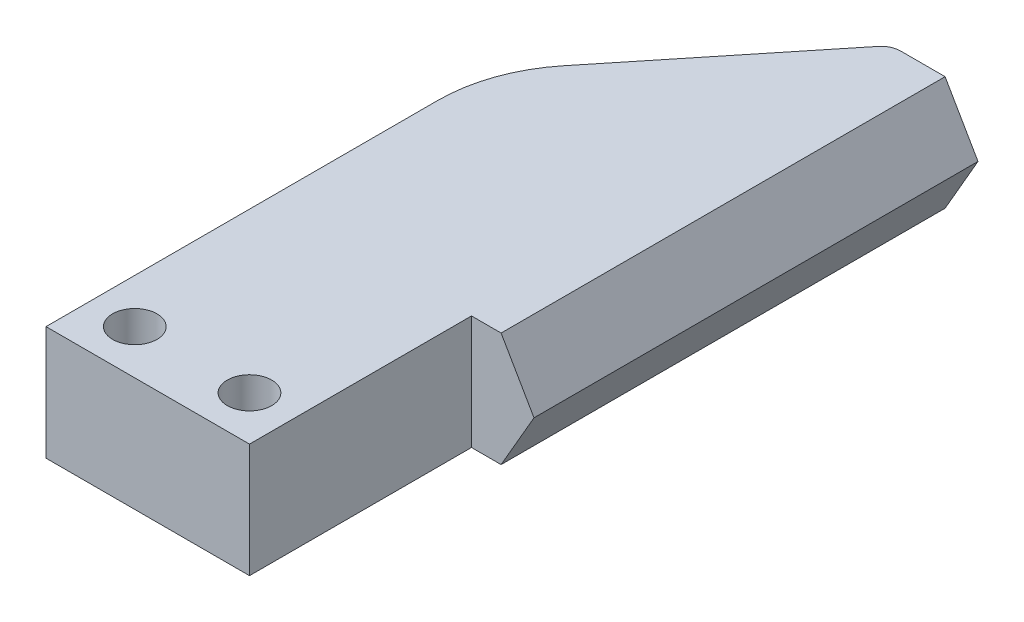
ISO-10303-21;
HEADER;
FILE_DESCRIPTION(('STEP AP214'),'2;1');
FILE_NAME('part.step','',(''),(''),'','','');
FILE_SCHEMA(('AUTOMOTIVE_DESIGN { 1 0 10303 214 1 1 1 1 }'));
ENDSEC;
DATA;
#1=APPLICATION_CONTEXT('core data for automotive mechanical design processes');
#2=APPLICATION_PROTOCOL_DEFINITION('international standard','automotive_design',2000,#1);
#3=PRODUCT_CONTEXT('',#1,'mechanical');
#4=PRODUCT('Part','Part','',(#3));
#5=PRODUCT_RELATED_PRODUCT_CATEGORY('part','',(#4));
#6=PRODUCT_DEFINITION_FORMATION('','',#4);
#7=PRODUCT_DEFINITION_CONTEXT('part definition',#1,'design');
#8=PRODUCT_DEFINITION('design','',#6,#7);
#9=PRODUCT_DEFINITION_SHAPE('','',#8);
#10=(LENGTH_UNIT() NAMED_UNIT(*) SI_UNIT(.MILLI.,.METRE.));
#11=(NAMED_UNIT(*) PLANE_ANGLE_UNIT() SI_UNIT($,.RADIAN.));
#12=(NAMED_UNIT(*) SI_UNIT($,.STERADIAN.) SOLID_ANGLE_UNIT());
#13=UNCERTAINTY_MEASURE_WITH_UNIT(LENGTH_MEASURE(1.E-05),#10,'distance_accuracy_value','');
#14=(GEOMETRIC_REPRESENTATION_CONTEXT(3) GLOBAL_UNCERTAINTY_ASSIGNED_CONTEXT((#13)) GLOBAL_UNIT_ASSIGNED_CONTEXT((#10,
#11,#12)) REPRESENTATION_CONTEXT('',''));
#15=CARTESIAN_POINT('',(0.,0.,0.));
#16=DIRECTION('',(0.,0.,1.));
#17=DIRECTION('',(1.,0.,0.));
#18=AXIS2_PLACEMENT_3D('',#15,#16,#17);
#19=CARTESIAN_POINT('',(-3.75,3.85,-11.4668726814975));
#20=DIRECTION('',(0.,-1.,0.));
#21=DIRECTION('',(0.,0.,-1.));
#22=AXIS2_PLACEMENT_3D('',#19,#20,#21);
#23=CYLINDRICAL_SURFACE('',#22,10.);
#24=CARTESIAN_POINT('',(-3.75,-3.85,-11.4668726814975));
#25=DIRECTION('',(0.,1.,0.));
#26=DIRECTION('',(0.,0.,1.));
#27=AXIS2_PLACEMENT_3D('',#24,#25,#26);
#28=CIRCLE('',#27,10.);
#29=CARTESIAN_POINT('',(-13.75,-3.85,-11.4668726814974));
#30=VERTEX_POINT('',#29);
#31=CARTESIAN_POINT('',(-11.5304663978605,-3.85,-17.7489378380972));
#32=VERTEX_POINT('',#31);
#33=EDGE_CURVE('E161',#30,#32,#28,.F.);
#34=ORIENTED_EDGE('',*,*,#33,.F.);
#35=DIRECTION('',(0.,-1.,0.));
#36=VECTOR('',#35,1.);
#37=CARTESIAN_POINT('',(-13.75,3.85,-11.4668726814974));
#38=LINE('',#37,#36);
#39=CARTESIAN_POINT('',(-13.75,3.85,-11.4668726814974));
#40=VERTEX_POINT('',#39);
#41=EDGE_CURVE('E12',#40,#30,#38,.T.);
#42=ORIENTED_EDGE('',*,*,#41,.F.);
#43=CARTESIAN_POINT('',(-3.75,3.85,-11.4668726814975));
#44=DIRECTION('',(0.,1.,0.));
#45=DIRECTION('',(0.,0.,1.));
#46=AXIS2_PLACEMENT_3D('',#43,#44,#45);
#47=CIRCLE('',#46,10.);
#48=CARTESIAN_POINT('',(-11.5304663978605,3.85,-17.7489378380972));
#49=VERTEX_POINT('',#48);
#50=EDGE_CURVE('E202',#40,#49,#47,.F.);
#51=ORIENTED_EDGE('',*,*,#50,.T.);
#52=DIRECTION('',(0.,-1.,0.));
#53=VECTOR('',#52,1.);
#54=CARTESIAN_POINT('',(-11.5304663978605,3.85,-17.7489378380972));
#55=LINE('',#54,#53);
#56=EDGE_CURVE('E64',#49,#32,#55,.T.);
#57=ORIENTED_EDGE('',*,*,#56,.T.);
#58=EDGE_LOOP('',(#34,#42,#51,#57));
#59=FACE_BOUND('',#58,.T.);
#60=ADVANCED_FACE('F47',(#59),#23,.T.);
#61=CARTESIAN_POINT('',(-13.75,3.85,0.));
#62=DIRECTION('',(-1.,0.,0.));
#63=DIRECTION('',(0.,0.,1.));
#64=AXIS2_PLACEMENT_3D('',#61,#62,#63);
#65=PLANE('',#64);
#66=DIRECTION('',(0.,0.,-1.));
#67=VECTOR('',#66,1.);
#68=CARTESIAN_POINT('',(-13.75,-3.85,0.));
#69=LINE('',#68,#67);
#70=CARTESIAN_POINT('',(-13.75,-3.85,15.));
#71=VERTEX_POINT('',#70);
#72=EDGE_CURVE('E164',#71,#30,#69,.T.);
#73=ORIENTED_EDGE('',*,*,#72,.F.);
#74=DIRECTION('',(0.,-1.,0.));
#75=VECTOR('',#74,1.);
#76=CARTESIAN_POINT('',(-13.75,3.85,15.));
#77=LINE('',#76,#75);
#78=CARTESIAN_POINT('',(-13.75,3.85,15.));
#79=VERTEX_POINT('',#78);
#80=EDGE_CURVE('E56',#79,#71,#77,.T.);
#81=ORIENTED_EDGE('',*,*,#80,.F.);
#82=DIRECTION('',(0.,0.,-1.));
#83=VECTOR('',#82,1.);
#84=CARTESIAN_POINT('',(-13.75,3.85,0.));
#85=LINE('',#84,#83);
#86=EDGE_CURVE('E227',#79,#40,#85,.T.);
#87=ORIENTED_EDGE('',*,*,#86,.T.);
#88=ORIENTED_EDGE('',*,*,#41,.T.);
#89=EDGE_LOOP('',(#73,#81,#87,#88));
#90=FACE_BOUND('',#89,.T.);
#91=ADVANCED_FACE('F226',(#90),#65,.T.);
#92=CARTESIAN_POINT('',(0.,3.85,15.));
#93=DIRECTION('',(0.,0.,-1.));
#94=DIRECTION('',(-1.,0.,0.));
#95=AXIS2_PLACEMENT_3D('',#92,#93,#94);
#96=PLANE('',#95);
#97=DIRECTION('',(1.,0.,0.));
#98=VECTOR('',#97,1.);
#99=CARTESIAN_POINT('',(0.,-3.85,15.));
#100=LINE('',#99,#98);
#101=CARTESIAN_POINT('',(0.,-3.85,15.));
#102=VERTEX_POINT('',#101);
#103=EDGE_CURVE('E169',#71,#102,#100,.T.);
#104=ORIENTED_EDGE('',*,*,#103,.T.);
#105=DIRECTION('',(0.,-1.,0.));
#106=VECTOR('',#105,1.);
#107=CARTESIAN_POINT('',(0.,3.85,15.));
#108=LINE('',#107,#106);
#109=CARTESIAN_POINT('',(0.,3.85,15.));
#110=VERTEX_POINT('',#109);
#111=EDGE_CURVE('E209',#110,#102,#108,.T.);
#112=ORIENTED_EDGE('',*,*,#111,.F.);
#113=DIRECTION('',(1.,0.,0.));
#114=VECTOR('',#113,1.);
#115=CARTESIAN_POINT('',(0.,3.85,15.));
#116=LINE('',#115,#114);
#117=EDGE_CURVE('E217',#79,#110,#116,.T.);
#118=ORIENTED_EDGE('',*,*,#117,.F.);
#119=ORIENTED_EDGE('',*,*,#80,.T.);
#120=EDGE_LOOP('',(#104,#112,#118,#119));
#121=FACE_BOUND('',#120,.T.);
#122=ADVANCED_FACE('F215',(#121),#96,.F.);
#123=CARTESIAN_POINT('',(0.,3.85,0.));
#124=DIRECTION('',(1.,0.,0.));
#125=DIRECTION('',(0.,0.,-1.));
#126=AXIS2_PLACEMENT_3D('',#123,#124,#125);
#127=PLANE('',#126);
#128=DIRECTION('',(0.,0.,1.));
#129=VECTOR('',#128,1.);
#130=CARTESIAN_POINT('',(0.,-3.85,0.));
#131=LINE('',#130,#129);
#132=CARTESIAN_POINT('',(0.,-3.85,0.));
#133=VERTEX_POINT('',#132);
#134=EDGE_CURVE('E173',#133,#102,#131,.T.);
#135=ORIENTED_EDGE('',*,*,#134,.F.);
#136=DIRECTION('',(0.,-1.,0.));
#137=VECTOR('',#136,1.);
#138=CARTESIAN_POINT('',(0.,3.85,0.));
#139=LINE('',#138,#137);
#140=CARTESIAN_POINT('',(0.,3.85,0.));
#141=VERTEX_POINT('',#140);
#142=EDGE_CURVE('E133',#141,#133,#139,.T.);
#143=ORIENTED_EDGE('',*,*,#142,.F.);
#144=DIRECTION('',(0.,0.,1.));
#145=VECTOR('',#144,1.);
#146=CARTESIAN_POINT('',(0.,3.85,0.));
#147=LINE('',#146,#145);
#148=EDGE_CURVE('E415',#141,#110,#147,.T.);
#149=ORIENTED_EDGE('',*,*,#148,.T.);
#150=ORIENTED_EDGE('',*,*,#111,.T.);
#151=EDGE_LOOP('',(#135,#143,#149,#150));
#152=FACE_BOUND('',#151,.T.);
#153=ADVANCED_FACE('F249',(#152),#127,.T.);
#154=CARTESIAN_POINT('',(0.,3.85,0.));
#155=DIRECTION('',(0.,0.,1.));
#156=DIRECTION('',(1.,0.,0.));
#157=AXIS2_PLACEMENT_3D('',#154,#155,#156);
#158=PLANE('',#157);
#159=DIRECTION('',(-1.,0.,0.));
#160=VECTOR('',#159,1.);
#161=CARTESIAN_POINT('',(0.,-3.85,0.));
#162=LINE('',#161,#160);
#163=CARTESIAN_POINT('',(2.,-3.85,0.));
#164=VERTEX_POINT('',#163);
#165=EDGE_CURVE('E177',#164,#133,#162,.T.);
#166=ORIENTED_EDGE('',*,*,#165,.F.);
#167=DIRECTION('',(-0.500000000000001,-0.866025403784438,0.));
#168=VECTOR('',#167,1.);
#169=CARTESIAN_POINT('',(4.22279853638006,0.,0.));
#170=LINE('',#169,#168);
#171=CARTESIAN_POINT('',(4.22279853638006,0.,0.));
#172=VERTEX_POINT('',#171);
#173=EDGE_CURVE('E404',#172,#164,#170,.T.);
#174=ORIENTED_EDGE('',*,*,#173,.F.);
#175=DIRECTION('',(0.500000000000001,-0.866025403784438,0.));
#176=VECTOR('',#175,1.);
#177=CARTESIAN_POINT('',(2.,3.85,0.));
#178=LINE('',#177,#176);
#179=CARTESIAN_POINT('',(2.,3.85,0.));
#180=VERTEX_POINT('',#179);
#181=EDGE_CURVE('E401',#180,#172,#178,.T.);
#182=ORIENTED_EDGE('',*,*,#181,.F.);
#183=DIRECTION('',(-1.,0.,0.));
#184=VECTOR('',#183,1.);
#185=CARTESIAN_POINT('',(0.,3.85,0.));
#186=LINE('',#185,#184);
#187=EDGE_CURVE('E419',#180,#141,#186,.T.);
#188=ORIENTED_EDGE('',*,*,#187,.T.);
#189=ORIENTED_EDGE('',*,*,#142,.T.);
#190=EDGE_LOOP('',(#166,#174,#182,#188,#189));
#191=FACE_BOUND('',#190,.T.);
#192=ADVANCED_FACE('F254',(#191),#158,.T.);
#193=CARTESIAN_POINT('',(0.,3.85,-30.));
#194=DIRECTION('',(0.,0.,-1.));
#195=DIRECTION('',(-1.,0.,0.));
#196=AXIS2_PLACEMENT_3D('',#193,#194,#195);
#197=PLANE('',#196);
#198=DIRECTION('',(1.,0.,0.));
#199=VECTOR('',#198,1.);
#200=CARTESIAN_POINT('',(0.,-3.85,-30.));
#201=LINE('',#200,#199);
#202=CARTESIAN_POINT('',(-1.,-3.85,-30.));
#203=VERTEX_POINT('',#202);
#204=CARTESIAN_POINT('',(2.,-3.85,-30.));
#205=VERTEX_POINT('',#204);
#206=EDGE_CURVE('E128',#203,#205,#201,.T.);
#207=ORIENTED_EDGE('',*,*,#206,.F.);
#208=DIRECTION('',(0.,-1.,0.));
#209=VECTOR('',#208,1.);
#210=CARTESIAN_POINT('',(-1.,3.85,-30.));
#211=LINE('',#210,#209);
#212=CARTESIAN_POINT('',(-1.,3.85,-30.));
#213=VERTEX_POINT('',#212);
#214=EDGE_CURVE('E121',#213,#203,#211,.T.);
#215=ORIENTED_EDGE('',*,*,#214,.F.);
#216=DIRECTION('',(1.,0.,0.));
#217=VECTOR('',#216,1.);
#218=CARTESIAN_POINT('',(0.,3.85,-30.));
#219=LINE('',#218,#217);
#220=CARTESIAN_POINT('',(2.,3.85,-30.));
#221=VERTEX_POINT('',#220);
#222=EDGE_CURVE('E125',#213,#221,#219,.T.);
#223=ORIENTED_EDGE('',*,*,#222,.T.);
#224=DIRECTION('',(0.500000000000001,-0.866025403784438,0.));
#225=VECTOR('',#224,1.);
#226=CARTESIAN_POINT('',(2.,3.85,-30.));
#227=LINE('',#226,#225);
#228=CARTESIAN_POINT('',(4.22279853638006,0.,-30.));
#229=VERTEX_POINT('',#228);
#230=EDGE_CURVE('E392',#221,#229,#227,.T.);
#231=ORIENTED_EDGE('',*,*,#230,.T.);
#232=DIRECTION('',(-0.500000000000001,-0.866025403784438,0.));
#233=VECTOR('',#232,1.);
#234=CARTESIAN_POINT('',(4.22279853638006,0.,-30.));
#235=LINE('',#234,#233);
#236=EDGE_CURVE('E398',#229,#205,#235,.T.);
#237=ORIENTED_EDGE('',*,*,#236,.T.);
#238=EDGE_LOOP('',(#207,#215,#223,#231,#237));
#239=FACE_BOUND('',#238,.T.);
#240=ADVANCED_FACE('F123',(#239),#197,.T.);
#241=CARTESIAN_POINT('',(-0.999999999999999,3.85,-28.6632446685966));
#242=DIRECTION('',(0.,-1.,0.));
#243=DIRECTION('',(0.,0.,-1.));
#244=AXIS2_PLACEMENT_3D('',#241,#242,#243);
#245=CYLINDRICAL_SURFACE('',#244,1.33675533140341);
#246=CARTESIAN_POINT('',(-0.999999999999999,-3.85,-28.6632446685966));
#247=DIRECTION('',(0.,1.,0.));
#248=DIRECTION('',(0.,0.,1.));
#249=AXIS2_PLACEMENT_3D('',#246,#247,#248);
#250=CIRCLE('',#249,1.33675533140341);
#251=CARTESIAN_POINT('',(-2.04005799381451,-3.85,-29.5030030776274));
#252=VERTEX_POINT('',#251);
#253=EDGE_CURVE('E187',#252,#203,#250,.F.);
#254=ORIENTED_EDGE('',*,*,#253,.F.);
#255=DIRECTION('',(0.,-1.,0.));
#256=VECTOR('',#255,1.);
#257=CARTESIAN_POINT('',(-2.04005799381451,3.85,-29.5030030776274));
#258=LINE('',#257,#256);
#259=CARTESIAN_POINT('',(-2.04005799381451,3.85,-29.5030030776274));
#260=VERTEX_POINT('',#259);
#261=EDGE_CURVE('E90',#260,#252,#258,.T.);
#262=ORIENTED_EDGE('',*,*,#261,.F.);
#263=CARTESIAN_POINT('',(-0.999999999999999,3.85,-28.6632446685966));
#264=DIRECTION('',(0.,1.,0.));
#265=DIRECTION('',(0.,0.,1.));
#266=AXIS2_PLACEMENT_3D('',#263,#264,#265);
#267=CIRCLE('',#266,1.33675533140341);
#268=EDGE_CURVE('E140',#260,#213,#267,.F.);
#269=ORIENTED_EDGE('',*,*,#268,.T.);
#270=ORIENTED_EDGE('',*,*,#214,.T.);
#271=EDGE_LOOP('',(#254,#262,#269,#270));
#272=FACE_BOUND('',#271,.T.);
#273=ADVANCED_FACE('F145',(#272),#245,.T.);
#274=CARTESIAN_POINT('',(-10.75,3.85,12.));
#275=DIRECTION('',(0.,-1.,0.));
#276=DIRECTION('',(0.,0.,-1.));
#277=AXIS2_PLACEMENT_3D('',#274,#275,#276);
#278=CYLINDRICAL_SURFACE('',#277,1.5);
#279=CARTESIAN_POINT('',(-10.75,3.85,12.));
#280=DIRECTION('',(0.,1.,0.));
#281=DIRECTION('',(0.,0.,1.));
#282=AXIS2_PLACEMENT_3D('',#279,#280,#281);
#283=CIRCLE('',#282,1.5);
#284=CARTESIAN_POINT('',(-10.75,3.85,13.5));
#285=VERTEX_POINT('',#284);
#286=EDGE_CURVE('E150',#285,#285,#283,.T.);
#287=ORIENTED_EDGE('',*,*,#286,.T.);
#288=EDGE_LOOP('',(#287));
#289=FACE_BOUND('',#288,.T.);
#290=CARTESIAN_POINT('',(-10.75,-3.85,12.));
#291=DIRECTION('',(0.,1.,0.));
#292=DIRECTION('',(0.,0.,1.));
#293=AXIS2_PLACEMENT_3D('',#290,#291,#292);
#294=CIRCLE('',#293,1.5);
#295=CARTESIAN_POINT('',(-10.75,-3.85,13.5));
#296=VERTEX_POINT('',#295);
#297=EDGE_CURVE('E194',#296,#296,#294,.T.);
#298=ORIENTED_EDGE('',*,*,#297,.F.);
#299=EDGE_LOOP('',(#298));
#300=FACE_BOUND('',#299,.T.);
#301=ADVANCED_FACE('F231',(#289,#300),#278,.F.);
#302=CARTESIAN_POINT('',(-15.6552624171466,3.85,-12.6402934630275));
#303=DIRECTION('',(-0.778046639786049,0.,-0.628206515659969));
#304=DIRECTION('',(-0.628206515659969,0.,0.778046639786049));
#305=AXIS2_PLACEMENT_3D('',#302,#303,#304);
#306=PLANE('',#305);
#307=DIRECTION('',(0.628206515659969,0.,-0.778046639786049));
#308=VECTOR('',#307,1.);
#309=CARTESIAN_POINT('',(-15.6552624171466,-3.85,-12.6402934630275));
#310=LINE('',#309,#308);
#311=EDGE_CURVE('E190',#32,#252,#310,.T.);
#312=ORIENTED_EDGE('',*,*,#311,.F.);
#313=ORIENTED_EDGE('',*,*,#56,.F.);
#314=DIRECTION('',(0.628206515659969,0.,-0.778046639786049));
#315=VECTOR('',#314,1.);
#316=CARTESIAN_POINT('',(-15.6552624171466,3.85,-12.6402934630275));
#317=LINE('',#316,#315);
#318=EDGE_CURVE('E147',#49,#260,#317,.T.);
#319=ORIENTED_EDGE('',*,*,#318,.T.);
#320=ORIENTED_EDGE('',*,*,#261,.T.);
#321=EDGE_LOOP('',(#312,#313,#319,#320));
#322=FACE_BOUND('',#321,.T.);
#323=ADVANCED_FACE('F228',(#322),#306,.T.);
#324=CARTESIAN_POINT('',(-3.,3.85,12.));
#325=DIRECTION('',(0.,-1.,0.));
#326=DIRECTION('',(0.,0.,-1.));
#327=AXIS2_PLACEMENT_3D('',#324,#325,#326);
#328=CYLINDRICAL_SURFACE('',#327,1.5);
#329=CARTESIAN_POINT('',(-3.,3.85,12.));
#330=DIRECTION('',(0.,1.,0.));
#331=DIRECTION('',(0.,0.,1.));
#332=AXIS2_PLACEMENT_3D('',#329,#330,#331);
#333=CIRCLE('',#332,1.5);
#334=CARTESIAN_POINT('',(-3.,3.85,13.5));
#335=VERTEX_POINT('',#334);
#336=EDGE_CURVE('E157',#335,#335,#333,.F.);
#337=ORIENTED_EDGE('',*,*,#336,.F.);
#338=EDGE_LOOP('',(#337));
#339=FACE_BOUND('',#338,.T.);
#340=CARTESIAN_POINT('',(-3.,-3.85,12.));
#341=DIRECTION('',(0.,1.,0.));
#342=DIRECTION('',(0.,0.,1.));
#343=AXIS2_PLACEMENT_3D('',#340,#341,#342);
#344=CIRCLE('',#343,1.5);
#345=CARTESIAN_POINT('',(-3.,-3.85,13.5));
#346=VERTEX_POINT('',#345);
#347=EDGE_CURVE('E198',#346,#346,#344,.F.);
#348=ORIENTED_EDGE('',*,*,#347,.T.);
#349=EDGE_LOOP('',(#348));
#350=FACE_BOUND('',#349,.T.);
#351=ADVANCED_FACE('F230',(#339,#350),#328,.F.);
#352=CARTESIAN_POINT('',(0.,3.85,0.));
#353=DIRECTION('',(0.,1.,0.));
#354=DIRECTION('',(0.,0.,1.));
#355=AXIS2_PLACEMENT_3D('',#352,#353,#354);
#356=PLANE('',#355);
#357=ORIENTED_EDGE('',*,*,#50,.F.);
#358=ORIENTED_EDGE('',*,*,#86,.F.);
#359=ORIENTED_EDGE('',*,*,#117,.T.);
#360=ORIENTED_EDGE('',*,*,#148,.F.);
#361=ORIENTED_EDGE('',*,*,#187,.F.);
#362=DIRECTION('',(0.,0.,1.));
#363=VECTOR('',#362,1.);
#364=CARTESIAN_POINT('',(2.,3.85,0.));
#365=LINE('',#364,#363);
#366=EDGE_CURVE('E142',#221,#180,#365,.T.);
#367=ORIENTED_EDGE('',*,*,#366,.F.);
#368=ORIENTED_EDGE('',*,*,#222,.F.);
#369=ORIENTED_EDGE('',*,*,#268,.F.);
#370=ORIENTED_EDGE('',*,*,#318,.F.);
#371=EDGE_LOOP('',(#357,#358,#359,#360,#361,#367,#368,#369,#370));
#372=FACE_BOUND('',#371,.T.);
#373=ORIENTED_EDGE('',*,*,#286,.F.);
#374=EDGE_LOOP('',(#373));
#375=FACE_BOUND('',#374,.T.);
#376=ORIENTED_EDGE('',*,*,#336,.T.);
#377=EDGE_LOOP('',(#376));
#378=FACE_BOUND('',#377,.T.);
#379=ADVANCED_FACE('F137',(#372,#375,#378),#356,.T.);
#380=CARTESIAN_POINT('',(0.,-3.85,0.));
#381=DIRECTION('',(0.,1.,0.));
#382=DIRECTION('',(0.,0.,1.));
#383=AXIS2_PLACEMENT_3D('',#380,#381,#382);
#384=PLANE('',#383);
#385=ORIENTED_EDGE('',*,*,#33,.T.);
#386=ORIENTED_EDGE('',*,*,#311,.T.);
#387=ORIENTED_EDGE('',*,*,#253,.T.);
#388=ORIENTED_EDGE('',*,*,#206,.T.);
#389=DIRECTION('',(0.,0.,1.));
#390=VECTOR('',#389,1.);
#391=CARTESIAN_POINT('',(2.,-3.85,0.));
#392=LINE('',#391,#390);
#393=EDGE_CURVE('E181',#205,#164,#392,.T.);
#394=ORIENTED_EDGE('',*,*,#393,.T.);
#395=ORIENTED_EDGE('',*,*,#165,.T.);
#396=ORIENTED_EDGE('',*,*,#134,.T.);
#397=ORIENTED_EDGE('',*,*,#103,.F.);
#398=ORIENTED_EDGE('',*,*,#72,.T.);
#399=EDGE_LOOP('',(#385,#386,#387,#388,#394,#395,#396,#397,#398));
#400=FACE_BOUND('',#399,.T.);
#401=ORIENTED_EDGE('',*,*,#297,.T.);
#402=EDGE_LOOP('',(#401));
#403=FACE_BOUND('',#402,.T.);
#404=ORIENTED_EDGE('',*,*,#347,.F.);
#405=EDGE_LOOP('',(#404));
#406=FACE_BOUND('',#405,.T.);
#407=ADVANCED_FACE('F223',(#400,#403,#406),#384,.F.);
#408=CARTESIAN_POINT('',(4.22279853638006,0.,0.));
#409=DIRECTION('',(0.866025403784438,-0.500000000000001,0.));
#410=DIRECTION('',(0.500000000000001,0.866025403784438,0.));
#411=AXIS2_PLACEMENT_3D('',#408,#409,#410);
#412=PLANE('',#411);
#413=ORIENTED_EDGE('',*,*,#236,.F.);
#414=DIRECTION('',(0.,0.,-1.));
#415=VECTOR('',#414,1.);
#416=CARTESIAN_POINT('',(4.22279853638006,0.,0.));
#417=LINE('',#416,#415);
#418=EDGE_CURVE('E165',#172,#229,#417,.T.);
#419=ORIENTED_EDGE('',*,*,#418,.F.);
#420=ORIENTED_EDGE('',*,*,#173,.T.);
#421=ORIENTED_EDGE('',*,*,#393,.F.);
#422=EDGE_LOOP('',(#413,#419,#420,#421));
#423=FACE_BOUND('',#422,.T.);
#424=ADVANCED_FACE('F315',(#423),#412,.T.);
#425=CARTESIAN_POINT('',(2.,3.85,0.));
#426=DIRECTION('',(0.866025403784438,0.500000000000001,0.));
#427=DIRECTION('',(-0.500000000000001,0.866025403784438,0.));
#428=AXIS2_PLACEMENT_3D('',#425,#426,#427);
#429=PLANE('',#428);
#430=ORIENTED_EDGE('',*,*,#230,.F.);
#431=ORIENTED_EDGE('',*,*,#366,.T.);
#432=ORIENTED_EDGE('',*,*,#181,.T.);
#433=ORIENTED_EDGE('',*,*,#418,.T.);
#434=EDGE_LOOP('',(#430,#431,#432,#433));
#435=FACE_BOUND('',#434,.T.);
#436=ADVANCED_FACE('F323',(#435),#429,.T.);
#437=CLOSED_SHELL('',(#60,#91,#122,#153,#192,#240,#273,#301,#323,#351,#379,#407,#424,#436));
#438=MANIFOLD_SOLID_BREP('B2',#437);
#439=ADVANCED_BREP_SHAPE_REPRESENTATION('',(#18,#438),#14);
#440=SHAPE_DEFINITION_REPRESENTATION(#9,#439);
ENDSEC;
END-ISO-10303-21;
